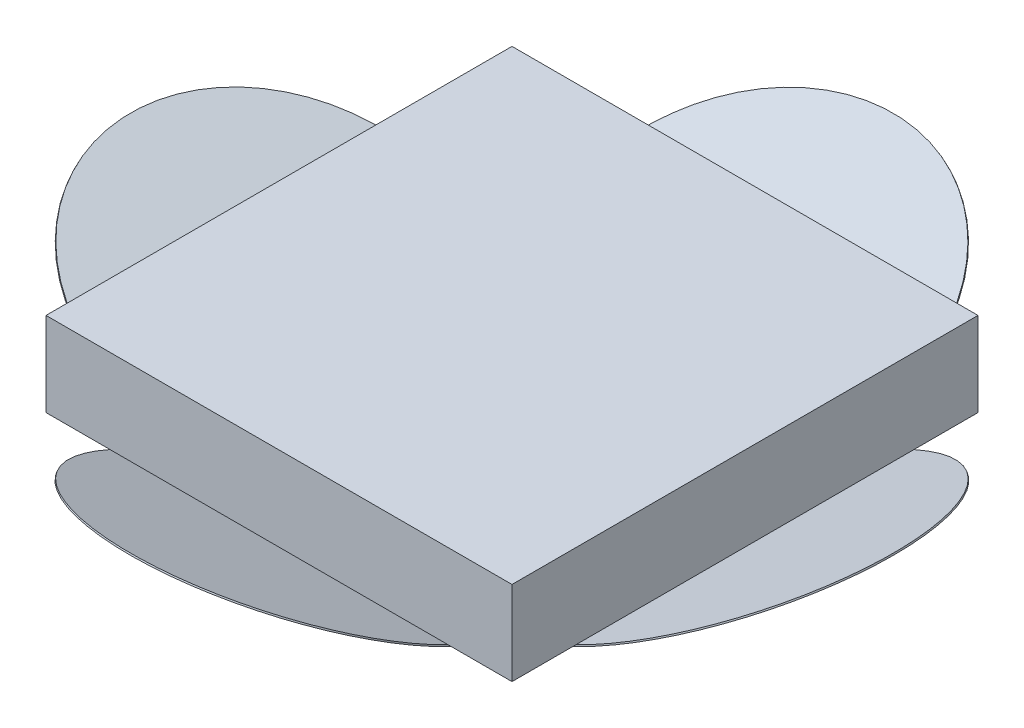
ISO-10303-21;
HEADER;
FILE_DESCRIPTION(('STEP AP214'),'2;1');
FILE_NAME('part.step','',(''),(''),'','','');
FILE_SCHEMA(('AUTOMOTIVE_DESIGN { 1 0 10303 214 1 1 1 1 }'));
ENDSEC;
DATA;
#1=APPLICATION_CONTEXT('core data for automotive mechanical design processes');
#2=APPLICATION_PROTOCOL_DEFINITION('international standard','automotive_design',2000,#1);
#3=PRODUCT_CONTEXT('',#1,'mechanical');
#4=PRODUCT('Part','Part','',(#3));
#5=PRODUCT_RELATED_PRODUCT_CATEGORY('part','',(#4));
#6=PRODUCT_DEFINITION_FORMATION('','',#4);
#7=PRODUCT_DEFINITION_CONTEXT('part definition',#1,'design');
#8=PRODUCT_DEFINITION('design','',#6,#7);
#9=PRODUCT_DEFINITION_SHAPE('','',#8);
#10=(LENGTH_UNIT() NAMED_UNIT(*) SI_UNIT(.MILLI.,.METRE.));
#11=(NAMED_UNIT(*) PLANE_ANGLE_UNIT() SI_UNIT($,.RADIAN.));
#12=(NAMED_UNIT(*) SI_UNIT($,.STERADIAN.) SOLID_ANGLE_UNIT());
#13=UNCERTAINTY_MEASURE_WITH_UNIT(LENGTH_MEASURE(1.E-05),#10,'distance_accuracy_value','');
#14=(GEOMETRIC_REPRESENTATION_CONTEXT(3) GLOBAL_UNCERTAINTY_ASSIGNED_CONTEXT((#13)) GLOBAL_UNIT_ASSIGNED_CONTEXT((#10,
#11,#12)) REPRESENTATION_CONTEXT('',''));
#15=CARTESIAN_POINT('',(0.,0.,0.));
#16=DIRECTION('',(0.,0.,1.));
#17=DIRECTION('',(1.,0.,0.));
#18=AXIS2_PLACEMENT_3D('',#15,#16,#17);
#19=CARTESIAN_POINT('',(-52.9596626410732,2.58867680453672,1.20347185474998));
#20=DIRECTION('',(0.,-0.906796627216048,-0.42156835373353));
#21=DIRECTION('',(0.,0.42156835373353,-0.906796627216049));
#22=AXIS2_PLACEMENT_3D('',#19,#20,#21);
#23=PLANE('',#22);
#24=DIRECTION('',(-1.,0.,0.));
#25=VECTOR('',#24,1.);
#26=CARTESIAN_POINT('',(0.,3.1481690140845,0.));
#27=LINE('',#26,#25);
#28=CARTESIAN_POINT('',(-47.5495984469937,3.1481690140845,0.));
#29=VERTEX_POINT('',#28);
#30=CARTESIAN_POINT('',(-51.9596626410732,3.1481690140845,0.));
#31=VERTEX_POINT('',#30);
#32=EDGE_CURVE('E330',#29,#31,#27,.T.);
#33=ORIENTED_EDGE('',*,*,#32,.F.);
#34=CARTESIAN_POINT('',(-35.9596626410732,2.98729015805943,0.3460516016962));
#35=DIRECTION('',(0.,-0.906796627216048,-0.42156835373353));
#36=DIRECTION('',(0.,0.42156835373353,-0.906796627216048));
#37=AXIS2_PLACEMENT_3D('',#34,#35,#36);
#38=CIRCLE('',#37,11.5962168702862);
#39=CARTESIAN_POINT('',(-44.5522706554002,-0.295515571756563,7.40739085365601));
#40=VERTEX_POINT('',#39);
#41=EDGE_CURVE('E159',#40,#29,#38,.T.);
#42=ORIENTED_EDGE('',*,*,#41,.F.);
#43=DIRECTION('',(-0.671741727957964,0.312291693517609,-0.671741727957964));
#44=VECTOR('',#43,1.);
#45=CARTESIAN_POINT('',(-28.739871455794,-7.64667610357636,23.2197911852792));
#46=LINE('',#45,#44);
#47=EDGE_CURVE('E141',#40,#31,#46,.T.);
#48=ORIENTED_EDGE('',*,*,#47,.T.);
#49=EDGE_LOOP('',(#33,#42,#48));
#50=FACE_BOUND('',#49,.T.);
#51=ADVANCED_FACE('F32',(#50),#23,.T.);
#52=CARTESIAN_POINT('',(-35.9596626410732,-4.29020631428936,16.));
#53=VERTEX_POINT('',#52);
#54=EDGE_CURVE('E157',#53,#40,#46,.T.);
#55=ORIENTED_EDGE('',*,*,#54,.T.);
#56=CARTESIAN_POINT('',(-27.3666314694174,-0.295318533680852,7.40696702330714));
#57=VERTEX_POINT('',#56);
#58=EDGE_CURVE('E119',#57,#40,#38,.T.);
#59=ORIENTED_EDGE('',*,*,#58,.F.);
#60=DIRECTION('',(-0.671741727957964,-0.312291693517609,0.671741727957964));
#61=VECTOR('',#60,1.);
#62=CARTESIAN_POINT('',(-34.3992450116317,-3.56477056448951,14.4395823705585));
#63=LINE('',#62,#61);
#64=EDGE_CURVE('E142',#57,#53,#63,.T.);
#65=ORIENTED_EDGE('',*,*,#64,.T.);
#66=EDGE_LOOP('',(#55,#59,#65));
#67=FACE_BOUND('',#66,.T.);
#68=ADVANCED_FACE('F154',(#67),#23,.T.);
#69=CARTESIAN_POINT('',(-19.9596626410732,3.1481690140845,0.));
#70=VERTEX_POINT('',#69);
#71=EDGE_CURVE('E132',#70,#57,#63,.T.);
#72=ORIENTED_EDGE('',*,*,#71,.T.);
#73=CARTESIAN_POINT('',(-24.3697268351527,3.1481690140845,0.));
#74=VERTEX_POINT('',#73);
#75=EDGE_CURVE('E115',#74,#57,#38,.T.);
#76=ORIENTED_EDGE('',*,*,#75,.F.);
#77=EDGE_CURVE('E138',#70,#74,#27,.T.);
#78=ORIENTED_EDGE('',*,*,#77,.F.);
#79=EDGE_LOOP('',(#72,#76,#78));
#80=FACE_BOUND('',#79,.T.);
#81=ADVANCED_FACE('F140',(#80),#23,.T.);
#82=CARTESIAN_POINT('',(-35.9596626410732,-4.29020631428936,32.));
#83=DIRECTION('',(0.42156835373353,0.906796627216049,0.));
#84=DIRECTION('',(-0.906796627216049,0.42156835373353,0.));
#85=AXIS2_PLACEMENT_3D('',#82,#83,#84);
#86=PLANE('',#85);
#87=CARTESIAN_POINT('',(-51.6219940888762,2.99118742484512,16.));
#88=DIRECTION('',(-0.42156835373353,-0.906796627216049,0.));
#89=DIRECTION('',(0.906796627216049,-0.42156835373353,0.));
#90=AXIS2_PLACEMENT_3D('',#87,#88,#89);
#91=CIRCLE('',#90,11.6024269112007);
#92=CARTESIAN_POINT('',(-51.9596626410732,3.1481690140845,4.40355024331792));
#93=VERTEX_POINT('',#92);
#94=EDGE_CURVE('E36',#93,#40,#91,.T.);
#95=ORIENTED_EDGE('',*,*,#94,.F.);
#96=DIRECTION('',(0.,0.,-1.));
#97=VECTOR('',#96,1.);
#98=CARTESIAN_POINT('',(-51.9596626410732,3.1481690140845,32.));
#99=LINE('',#98,#97);
#100=EDGE_CURVE('E305',#93,#31,#99,.T.);
#101=ORIENTED_EDGE('',*,*,#100,.T.);
#102=ORIENTED_EDGE('',*,*,#47,.F.);
#103=EDGE_LOOP('',(#95,#101,#102));
#104=FACE_BOUND('',#103,.T.);
#105=ADVANCED_FACE('F283',(#104),#86,.F.);
#106=CARTESIAN_POINT('',(-44.5570397132548,-0.293298970386691,24.5973770721816));
#107=VERTEX_POINT('',#106);
#108=EDGE_CURVE('E58',#40,#107,#91,.T.);
#109=ORIENTED_EDGE('',*,*,#108,.F.);
#110=ORIENTED_EDGE('',*,*,#54,.F.);
#111=CARTESIAN_POINT('',(-44.5545714308906,-0.294446471051778,24.5949087898174));
#112=DIRECTION('',(0.671741727957965,-0.312291693517609,-0.671741727957964));
#113=VECTOR('',#112,1.);
#114=LINE('',#111,#113);
#115=EDGE_CURVE('E166',#107,#53,#114,.T.);
#116=ORIENTED_EDGE('',*,*,#115,.F.);
#117=EDGE_LOOP('',(#109,#110,#116));
#118=FACE_BOUND('',#117,.T.);
#119=ADVANCED_FACE('F286',(#118),#86,.F.);
#120=CARTESIAN_POINT('',(-51.9596626410732,3.1481690140845,27.5964497566821));
#121=VERTEX_POINT('',#120);
#122=EDGE_CURVE('E235',#107,#121,#91,.T.);
#123=ORIENTED_EDGE('',*,*,#122,.F.);
#124=DIRECTION('',(0.671741727957964,-0.312291693517609,-0.671741727957964));
#125=VECTOR('',#124,1.);
#126=CARTESIAN_POINT('',(-43.1794538263524,-0.933736525002352,23.2197911852792));
#127=LINE('',#126,#125);
#128=CARTESIAN_POINT('',(-51.9596626410732,3.1481690140845,32.));
#129=VERTEX_POINT('',#128);
#130=EDGE_CURVE('E163',#129,#107,#127,.T.);
#131=ORIENTED_EDGE('',*,*,#130,.F.);
#132=EDGE_CURVE('E326',#129,#121,#99,.T.);
#133=ORIENTED_EDGE('',*,*,#132,.T.);
#134=EDGE_LOOP('',(#123,#131,#133));
#135=FACE_BOUND('',#134,.T.);
#136=ADVANCED_FACE('F259',(#135),#86,.F.);
#137=CARTESIAN_POINT('',(-52.9596626410732,-9.64417955727407,4.48356420507719));
#138=DIRECTION('',(0.,-0.906796627216048,0.42156835373353));
#139=DIRECTION('',(0.,-0.42156835373353,-0.906796627216049));
#140=AXIS2_PLACEMENT_3D('',#137,#138,#139);
#141=PLANE('',#140);
#142=DIRECTION('',(1.,0.,0.));
#143=VECTOR('',#142,1.);
#144=CARTESIAN_POINT('',(-52.9596626410732,3.1481690140845,32.));
#145=LINE('',#144,#143);
#146=CARTESIAN_POINT('',(-24.3552867854138,3.14816901408451,32.));
#147=VERTEX_POINT('',#146);
#148=CARTESIAN_POINT('',(-19.9596626410732,3.1481690140845,32.));
#149=VERTEX_POINT('',#148);
#150=EDGE_CURVE('E338',#147,#149,#145,.T.);
#151=ORIENTED_EDGE('',*,*,#150,.F.);
#152=CARTESIAN_POINT('',(-35.9596626410732,2.99593579768266,31.6725452326749));
#153=DIRECTION('',(0.,-0.906796627216048,0.42156835373353));
#154=DIRECTION('',(0.,-0.42156835373353,-0.906796627216048));
#155=AXIS2_PLACEMENT_3D('',#152,#153,#154);
#156=CIRCLE('',#155,11.6099931342026);
#157=CARTESIAN_POINT('',(-27.3608598825106,-0.292635818973298,24.5988035157456));
#158=VERTEX_POINT('',#157);
#159=EDGE_CURVE('E207',#158,#147,#156,.T.);
#160=ORIENTED_EDGE('',*,*,#159,.F.);
#161=DIRECTION('',(0.671741727957964,0.312291693517609,0.671741727957964));
#162=VECTOR('',#161,1.);
#163=CARTESIAN_POINT('',(-19.9596626410732,3.1481690140845,32.));
#164=LINE('',#163,#162);
#165=EDGE_CURVE('E213',#158,#149,#164,.T.);
#166=ORIENTED_EDGE('',*,*,#165,.T.);
#167=EDGE_LOOP('',(#151,#160,#166));
#168=FACE_BOUND('',#167,.T.);
#169=ADVANCED_FACE('F248',(#168),#141,.T.);
#170=ORIENTED_EDGE('',*,*,#130,.T.);
#171=CARTESIAN_POINT('',(-47.5640384967326,3.14816901408451,32.));
#172=VERTEX_POINT('',#171);
#173=EDGE_CURVE('E218',#172,#107,#156,.T.);
#174=ORIENTED_EDGE('',*,*,#173,.F.);
#175=EDGE_CURVE('E201',#129,#172,#145,.T.);
#176=ORIENTED_EDGE('',*,*,#175,.F.);
#177=EDGE_LOOP('',(#170,#174,#176));
#178=FACE_BOUND('',#177,.T.);
#179=ADVANCED_FACE('F258',(#178),#141,.T.);
#180=EDGE_CURVE('E162',#53,#158,#164,.T.);
#181=ORIENTED_EDGE('',*,*,#180,.T.);
#182=EDGE_CURVE('E224',#107,#158,#156,.T.);
#183=ORIENTED_EDGE('',*,*,#182,.F.);
#184=ORIENTED_EDGE('',*,*,#115,.T.);
#185=EDGE_LOOP('',(#181,#183,#184));
#186=FACE_BOUND('',#185,.T.);
#187=ADVANCED_FACE('F261',(#186),#141,.T.);
#188=CARTESIAN_POINT('',(-19.9596626410732,3.1481690140845,32.));
#189=DIRECTION('',(-0.42156835373353,0.906796627216049,0.));
#190=DIRECTION('',(-0.906796627216048,-0.42156835373353,0.));
#191=AXIS2_PLACEMENT_3D('',#188,#189,#190);
#192=PLANE('',#191);
#193=CARTESIAN_POINT('',(-20.294569642075,2.99247126573755,16.));
#194=DIRECTION('',(0.42156835373353,-0.906796627216048,0.));
#195=DIRECTION('',(0.906796627216048,0.42156835373353,0.));
#196=AXIS2_PLACEMENT_3D('',#193,#194,#195);
#197=CIRCLE('',#196,11.6044726280859);
#198=CARTESIAN_POINT('',(-19.9596626410732,3.14816901408451,27.5985939013242));
#199=VERTEX_POINT('',#198);
#200=EDGE_CURVE('E147',#199,#158,#197,.T.);
#201=ORIENTED_EDGE('',*,*,#200,.F.);
#202=DIRECTION('',(0.,0.,-1.));
#203=VECTOR('',#202,1.);
#204=CARTESIAN_POINT('',(-19.9596626410732,3.1481690140845,32.));
#205=LINE('',#204,#203);
#206=EDGE_CURVE('E322',#149,#199,#205,.T.);
#207=ORIENTED_EDGE('',*,*,#206,.F.);
#208=ORIENTED_EDGE('',*,*,#165,.F.);
#209=EDGE_LOOP('',(#201,#207,#208));
#210=FACE_BOUND('',#209,.T.);
#211=ADVANCED_FACE('F279',(#210),#192,.F.);
#212=EDGE_CURVE('E11',#158,#57,#197,.T.);
#213=ORIENTED_EDGE('',*,*,#212,.F.);
#214=ORIENTED_EDGE('',*,*,#180,.F.);
#215=ORIENTED_EDGE('',*,*,#64,.F.);
#216=EDGE_LOOP('',(#213,#214,#215));
#217=FACE_BOUND('',#216,.T.);
#218=ADVANCED_FACE('F161',(#217),#192,.F.);
#219=CARTESIAN_POINT('',(-19.9596626410732,3.14816901408451,4.40140609867577));
#220=VERTEX_POINT('',#219);
#221=EDGE_CURVE('E42',#57,#220,#197,.T.);
#222=ORIENTED_EDGE('',*,*,#221,.F.);
#223=ORIENTED_EDGE('',*,*,#71,.F.);
#224=EDGE_CURVE('E134',#220,#70,#205,.T.);
#225=ORIENTED_EDGE('',*,*,#224,.F.);
#226=EDGE_LOOP('',(#222,#223,#225));
#227=FACE_BOUND('',#226,.T.);
#228=ADVANCED_FACE('F131',(#227),#192,.F.);
#229=CARTESIAN_POINT('',(0.,0.,32.));
#230=DIRECTION('',(0.,0.,-1.));
#231=DIRECTION('',(-1.,0.,0.));
#232=AXIS2_PLACEMENT_3D('',#229,#230,#231);
#233=PLANE('',#232);
#234=ORIENTED_EDGE('',*,*,#175,.T.);
#235=DIRECTION('',(-1.,0.,0.));
#236=VECTOR('',#235,1.);
#237=CARTESIAN_POINT('',(0.,3.14816901408451,32.));
#238=LINE('',#237,#236);
#239=EDGE_CURVE('E198',#147,#172,#238,.T.);
#240=ORIENTED_EDGE('',*,*,#239,.F.);
#241=ORIENTED_EDGE('',*,*,#150,.T.);
#242=DIRECTION('',(0.,1.,0.));
#243=VECTOR('',#242,1.);
#244=CARTESIAN_POINT('',(-19.9596626410732,8.92782935791853,32.));
#245=LINE('',#244,#243);
#246=CARTESIAN_POINT('',(-19.9596626410732,8.92782935791853,32.));
#247=VERTEX_POINT('',#246);
#248=EDGE_CURVE('E321',#149,#247,#245,.T.);
#249=ORIENTED_EDGE('',*,*,#248,.T.);
#250=DIRECTION('',(-1.,0.,0.));
#251=VECTOR('',#250,1.);
#252=CARTESIAN_POINT('',(-51.9596626410732,8.92782935791853,32.));
#253=LINE('',#252,#251);
#254=CARTESIAN_POINT('',(-51.9596626410732,8.92782935791853,32.));
#255=VERTEX_POINT('',#254);
#256=EDGE_CURVE('E179',#247,#255,#253,.T.);
#257=ORIENTED_EDGE('',*,*,#256,.T.);
#258=DIRECTION('',(0.,-1.,0.));
#259=VECTOR('',#258,1.);
#260=CARTESIAN_POINT('',(-51.9596626410732,8.92782935791853,32.));
#261=LINE('',#260,#259);
#262=EDGE_CURVE('E401',#255,#129,#261,.T.);
#263=ORIENTED_EDGE('',*,*,#262,.T.);
#264=EDGE_LOOP('',(#234,#240,#241,#249,#257,#263));
#265=FACE_BOUND('',#264,.T.);
#266=ADVANCED_FACE('F266',(#265),#233,.F.);
#267=CARTESIAN_POINT('',(0.,0.,0.));
#268=DIRECTION('',(0.,0.,-1.));
#269=DIRECTION('',(-1.,0.,0.));
#270=AXIS2_PLACEMENT_3D('',#267,#268,#269);
#271=PLANE('',#270);
#272=DIRECTION('',(0.,1.,0.));
#273=VECTOR('',#272,1.);
#274=CARTESIAN_POINT('',(-19.9596626410732,8.92782935791853,0.));
#275=LINE('',#274,#273);
#276=CARTESIAN_POINT('',(-19.9596626410732,8.92782935791853,0.));
#277=VERTEX_POINT('',#276);
#278=EDGE_CURVE('E311',#70,#277,#275,.T.);
#279=ORIENTED_EDGE('',*,*,#278,.F.);
#280=ORIENTED_EDGE('',*,*,#77,.T.);
#281=DIRECTION('',(-1.,0.,0.));
#282=VECTOR('',#281,1.);
#283=CARTESIAN_POINT('',(0.,3.1481690140845,0.));
#284=LINE('',#283,#282);
#285=EDGE_CURVE('E189',#74,#29,#284,.T.);
#286=ORIENTED_EDGE('',*,*,#285,.T.);
#287=ORIENTED_EDGE('',*,*,#32,.T.);
#288=DIRECTION('',(0.,-1.,0.));
#289=VECTOR('',#288,1.);
#290=CARTESIAN_POINT('',(-51.9596626410732,8.92782935791853,0.));
#291=LINE('',#290,#289);
#292=CARTESIAN_POINT('',(-51.9596626410732,8.92782935791853,0.));
#293=VERTEX_POINT('',#292);
#294=EDGE_CURVE('E303',#293,#31,#291,.T.);
#295=ORIENTED_EDGE('',*,*,#294,.F.);
#296=DIRECTION('',(-1.,0.,0.));
#297=VECTOR('',#296,1.);
#298=CARTESIAN_POINT('',(-51.9596626410732,8.92782935791853,0.));
#299=LINE('',#298,#297);
#300=EDGE_CURVE('E312',#277,#293,#299,.T.);
#301=ORIENTED_EDGE('',*,*,#300,.F.);
#302=EDGE_LOOP('',(#279,#280,#286,#287,#295,#301));
#303=FACE_BOUND('',#302,.T.);
#304=ADVANCED_FACE('F269',(#303),#271,.T.);
#305=CARTESIAN_POINT('',(-51.9596626410732,8.92782935791853,32.));
#306=DIRECTION('',(0.,-1.,0.));
#307=DIRECTION('',(0.,0.,-1.));
#308=AXIS2_PLACEMENT_3D('',#305,#306,#307);
#309=PLANE('',#308);
#310=ORIENTED_EDGE('',*,*,#300,.T.);
#311=DIRECTION('',(0.,0.,-1.));
#312=VECTOR('',#311,1.);
#313=CARTESIAN_POINT('',(-51.9596626410732,8.92782935791853,32.));
#314=LINE('',#313,#312);
#315=EDGE_CURVE('E308',#255,#293,#314,.T.);
#316=ORIENTED_EDGE('',*,*,#315,.F.);
#317=ORIENTED_EDGE('',*,*,#256,.F.);
#318=DIRECTION('',(0.,0.,-1.));
#319=VECTOR('',#318,1.);
#320=CARTESIAN_POINT('',(-19.9596626410732,8.92782935791853,32.));
#321=LINE('',#320,#319);
#322=EDGE_CURVE('E318',#247,#277,#321,.T.);
#323=ORIENTED_EDGE('',*,*,#322,.T.);
#324=EDGE_LOOP('',(#310,#316,#317,#323));
#325=FACE_BOUND('',#324,.T.);
#326=ADVANCED_FACE('F34',(#325),#309,.F.);
#327=CARTESIAN_POINT('',(-51.9596626410732,8.92782935791853,32.));
#328=DIRECTION('',(1.,0.,0.));
#329=DIRECTION('',(0.,1.,0.));
#330=AXIS2_PLACEMENT_3D('',#327,#328,#329);
#331=PLANE('',#330);
#332=ORIENTED_EDGE('',*,*,#294,.T.);
#333=ORIENTED_EDGE('',*,*,#100,.F.);
#334=DIRECTION('',(0.,0.,-1.));
#335=VECTOR('',#334,1.);
#336=CARTESIAN_POINT('',(-51.9596626410732,3.1481690140845,32.));
#337=LINE('',#336,#335);
#338=EDGE_CURVE('E225',#121,#93,#337,.T.);
#339=ORIENTED_EDGE('',*,*,#338,.F.);
#340=ORIENTED_EDGE('',*,*,#132,.F.);
#341=ORIENTED_EDGE('',*,*,#262,.F.);
#342=ORIENTED_EDGE('',*,*,#315,.T.);
#343=EDGE_LOOP('',(#332,#333,#339,#340,#341,#342));
#344=FACE_BOUND('',#343,.T.);
#345=ADVANCED_FACE('F277',(#344),#331,.F.);
#346=CARTESIAN_POINT('',(-19.9596626410732,8.92782935791853,32.));
#347=DIRECTION('',(-1.,0.,0.));
#348=DIRECTION('',(0.,0.,1.));
#349=AXIS2_PLACEMENT_3D('',#346,#347,#348);
#350=PLANE('',#349);
#351=ORIENTED_EDGE('',*,*,#278,.T.);
#352=ORIENTED_EDGE('',*,*,#322,.F.);
#353=ORIENTED_EDGE('',*,*,#248,.F.);
#354=ORIENTED_EDGE('',*,*,#206,.T.);
#355=EDGE_CURVE('E325',#199,#220,#205,.T.);
#356=ORIENTED_EDGE('',*,*,#355,.T.);
#357=ORIENTED_EDGE('',*,*,#224,.T.);
#358=EDGE_LOOP('',(#351,#352,#353,#354,#356,#357));
#359=FACE_BOUND('',#358,.T.);
#360=ADVANCED_FACE('F274',(#359),#350,.F.);
#361=CARTESIAN_POINT('',(-20.2524128067016,2.90179160301595,16.));
#362=DIRECTION('',(-0.42156835373353,0.906796627216048,0.));
#363=DIRECTION('',(-0.906796627216049,-0.42156835373353,0.));
#364=AXIS2_PLACEMENT_3D('',#361,#362,#363);
#365=CYLINDRICAL_SURFACE('',#364,11.6044726280859);
#366=CARTESIAN_POINT('',(-20.2524128067016,2.90179160301595,16.));
#367=DIRECTION('',(0.42156835373353,-0.906796627216048,0.));
#368=DIRECTION('',(0.906796627216048,0.42156835373353,0.));
#369=AXIS2_PLACEMENT_3D('',#366,#367,#368);
#370=CIRCLE('',#369,11.6044726280859);
#371=CARTESIAN_POINT('',(-9.72951616693233,7.79387002478396,16.));
#372=VERTEX_POINT('',#371);
#373=EDGE_CURVE('E199',#372,#372,#370,.T.);
#374=ORIENTED_EDGE('',*,*,#373,.F.);
#375=EDGE_LOOP('',(#374));
#376=FACE_BOUND('',#375,.T.);
#377=ORIENTED_EDGE('',*,*,#200,.T.);
#378=ORIENTED_EDGE('',*,*,#212,.T.);
#379=ORIENTED_EDGE('',*,*,#221,.T.);
#380=EDGE_CURVE('E194',#220,#199,#197,.T.);
#381=ORIENTED_EDGE('',*,*,#380,.T.);
#382=EDGE_LOOP('',(#377,#378,#379,#381));
#383=FACE_BOUND('',#382,.T.);
#384=ADVANCED_FACE('F146',(#376,#383),#365,.T.);
#385=CARTESIAN_POINT('',(-20.2524128067016,2.90179160301595,16.));
#386=DIRECTION('',(0.42156835373353,-0.906796627216048,0.));
#387=DIRECTION('',(0.906796627216048,0.42156835373353,0.));
#388=AXIS2_PLACEMENT_3D('',#385,#386,#387);
#389=PLANE('',#388);
#390=ORIENTED_EDGE('',*,*,#373,.T.);
#391=EDGE_LOOP('',(#390));
#392=FACE_BOUND('',#391,.T.);
#393=ADVANCED_FACE('F344',(#392),#389,.T.);
#394=CARTESIAN_POINT('',(-20.294569642075,2.99247126573755,16.));
#395=DIRECTION('',(0.42156835373353,-0.906796627216048,0.));
#396=DIRECTION('',(0.906796627216048,0.42156835373353,0.));
#397=AXIS2_PLACEMENT_3D('',#394,#395,#396);
#398=PLANE('',#397);
#399=ORIENTED_EDGE('',*,*,#355,.F.);
#400=ORIENTED_EDGE('',*,*,#380,.F.);
#401=EDGE_LOOP('',(#399,#400));
#402=FACE_BOUND('',#401,.T.);
#403=ADVANCED_FACE('F350',(#402),#398,.F.);
#404=CARTESIAN_POINT('',(-35.9596626410732,2.99593579768266,31.6725452326749));
#405=DIRECTION('',(0.,-0.906796627216048,0.42156835373353));
#406=DIRECTION('',(0.,-0.42156835373353,-0.906796627216048));
#407=AXIS2_PLACEMENT_3D('',#404,#405,#406);
#408=PLANE('',#407);
#409=EDGE_CURVE('E212',#147,#172,#156,.T.);
#410=ORIENTED_EDGE('',*,*,#409,.F.);
#411=ORIENTED_EDGE('',*,*,#239,.T.);
#412=EDGE_LOOP('',(#410,#411));
#413=FACE_BOUND('',#412,.T.);
#414=ADVANCED_FACE('F355',(#413),#408,.F.);
#415=CARTESIAN_POINT('',(-35.9596626410732,2.90525613496105,31.7147020680482));
#416=DIRECTION('',(0.,0.906796627216048,-0.42156835373353));
#417=DIRECTION('',(0.,0.42156835373353,0.906796627216048));
#418=AXIS2_PLACEMENT_3D('',#415,#416,#417);
#419=CYLINDRICAL_SURFACE('',#418,11.6099931342026);
#420=CARTESIAN_POINT('',(-35.9596626410732,2.90525613496105,31.7147020680482));
#421=DIRECTION('',(0.,-0.906796627216048,0.42156835373353));
#422=DIRECTION('',(0.,-0.42156835373353,-0.906796627216048));
#423=AXIS2_PLACEMENT_3D('',#420,#421,#422);
#424=CIRCLE('',#423,11.6099931342026);
#425=CARTESIAN_POINT('',(-35.9596626410732,-1.98914955748232,21.1867994519519));
#426=VERTEX_POINT('',#425);
#427=EDGE_CURVE('E211',#426,#426,#424,.T.);
#428=ORIENTED_EDGE('',*,*,#427,.F.);
#429=EDGE_LOOP('',(#428));
#430=FACE_BOUND('',#429,.T.);
#431=ORIENTED_EDGE('',*,*,#173,.T.);
#432=ORIENTED_EDGE('',*,*,#182,.T.);
#433=ORIENTED_EDGE('',*,*,#159,.T.);
#434=ORIENTED_EDGE('',*,*,#409,.T.);
#435=EDGE_LOOP('',(#431,#432,#433,#434));
#436=FACE_BOUND('',#435,.T.);
#437=ADVANCED_FACE('F358',(#430,#436),#419,.T.);
#438=CARTESIAN_POINT('',(-35.9596626410732,2.90525613496105,31.7147020680482));
#439=DIRECTION('',(0.,-0.906796627216048,0.42156835373353));
#440=DIRECTION('',(0.,-0.42156835373353,-0.906796627216048));
#441=AXIS2_PLACEMENT_3D('',#438,#439,#440);
#442=PLANE('',#441);
#443=ORIENTED_EDGE('',*,*,#427,.T.);
#444=EDGE_LOOP('',(#443));
#445=FACE_BOUND('',#444,.T.);
#446=ADVANCED_FACE('F361',(#445),#442,.T.);
#447=CARTESIAN_POINT('',(-51.6219940888762,2.99118742484512,16.));
#448=DIRECTION('',(-0.42156835373353,-0.906796627216049,0.));
#449=DIRECTION('',(0.906796627216049,-0.42156835373353,0.));
#450=AXIS2_PLACEMENT_3D('',#447,#448,#449);
#451=PLANE('',#450);
#452=EDGE_CURVE('E236',#121,#93,#91,.T.);
#453=ORIENTED_EDGE('',*,*,#452,.F.);
#454=ORIENTED_EDGE('',*,*,#338,.T.);
#455=EDGE_LOOP('',(#453,#454));
#456=FACE_BOUND('',#455,.T.);
#457=ADVANCED_FACE('F368',(#456),#451,.F.);
#458=CARTESIAN_POINT('',(-51.6641509242495,2.90050776212351,16.));
#459=DIRECTION('',(0.42156835373353,0.906796627216048,0.));
#460=DIRECTION('',(-0.906796627216048,0.42156835373353,0.));
#461=AXIS2_PLACEMENT_3D('',#458,#459,#460);
#462=CYLINDRICAL_SURFACE('',#461,11.6024269112007);
#463=CARTESIAN_POINT('',(-51.6641509242495,2.90050776212351,16.));
#464=DIRECTION('',(-0.42156835373353,-0.906796627216049,0.));
#465=DIRECTION('',(0.906796627216049,-0.42156835373353,0.));
#466=AXIS2_PLACEMENT_3D('',#463,#464,#465);
#467=CIRCLE('',#466,11.6024269112007);
#468=CARTESIAN_POINT('',(-41.143109333652,-1.99070825014499,16.));
#469=VERTEX_POINT('',#468);
#470=EDGE_CURVE('E230',#469,#469,#467,.T.);
#471=ORIENTED_EDGE('',*,*,#470,.F.);
#472=EDGE_LOOP('',(#471));
#473=FACE_BOUND('',#472,.T.);
#474=ORIENTED_EDGE('',*,*,#94,.T.);
#475=ORIENTED_EDGE('',*,*,#108,.T.);
#476=ORIENTED_EDGE('',*,*,#122,.T.);
#477=ORIENTED_EDGE('',*,*,#452,.T.);
#478=EDGE_LOOP('',(#474,#475,#476,#477));
#479=FACE_BOUND('',#478,.T.);
#480=ADVANCED_FACE('F370',(#473,#479),#462,.T.);
#481=CARTESIAN_POINT('',(-51.6641509242495,2.90050776212351,16.));
#482=DIRECTION('',(-0.42156835373353,-0.906796627216049,0.));
#483=DIRECTION('',(0.906796627216049,-0.42156835373353,0.));
#484=AXIS2_PLACEMENT_3D('',#481,#482,#483);
#485=PLANE('',#484);
#486=ORIENTED_EDGE('',*,*,#470,.T.);
#487=EDGE_LOOP('',(#486));
#488=FACE_BOUND('',#487,.T.);
#489=ADVANCED_FACE('F373',(#488),#485,.T.);
#490=CARTESIAN_POINT('',(-35.9596626410732,2.89661049533782,0.303894766322847));
#491=DIRECTION('',(0.,0.906796627216048,0.42156835373353));
#492=DIRECTION('',(0.,-0.42156835373353,0.906796627216048));
#493=AXIS2_PLACEMENT_3D('',#490,#491,#492);
#494=CYLINDRICAL_SURFACE('',#493,11.5962168702862);
#495=CARTESIAN_POINT('',(-35.9596626410732,2.89661049533782,0.303894766322847));
#496=DIRECTION('',(0.,-0.906796627216048,-0.42156835373353));
#497=DIRECTION('',(0.,0.42156835373353,-0.906796627216048));
#498=AXIS2_PLACEMENT_3D('',#495,#496,#497);
#499=CIRCLE('',#498,11.5962168702862);
#500=CARTESIAN_POINT('',(-35.9596626410732,7.78520855088138,-10.2115155801186));
#501=VERTEX_POINT('',#500);
#502=EDGE_CURVE('E125',#501,#501,#499,.T.);
#503=ORIENTED_EDGE('',*,*,#502,.F.);
#504=EDGE_LOOP('',(#503));
#505=FACE_BOUND('',#504,.T.);
#506=ORIENTED_EDGE('',*,*,#75,.T.);
#507=ORIENTED_EDGE('',*,*,#58,.T.);
#508=ORIENTED_EDGE('',*,*,#41,.T.);
#509=EDGE_CURVE('E50',#29,#74,#38,.T.);
#510=ORIENTED_EDGE('',*,*,#509,.T.);
#511=EDGE_LOOP('',(#506,#507,#508,#510));
#512=FACE_BOUND('',#511,.T.);
#513=ADVANCED_FACE('F117',(#505,#512),#494,.T.);
#514=CARTESIAN_POINT('',(-35.9596626410732,2.89661049533782,0.303894766322847));
#515=DIRECTION('',(0.,-0.906796627216048,-0.42156835373353));
#516=DIRECTION('',(0.,0.42156835373353,-0.906796627216048));
#517=AXIS2_PLACEMENT_3D('',#514,#515,#516);
#518=PLANE('',#517);
#519=ORIENTED_EDGE('',*,*,#502,.T.);
#520=EDGE_LOOP('',(#519));
#521=FACE_BOUND('',#520,.T.);
#522=ADVANCED_FACE('F382',(#521),#518,.T.);
#523=CARTESIAN_POINT('',(-35.9596626410732,2.98729015805943,0.3460516016962));
#524=DIRECTION('',(0.,-0.906796627216048,-0.42156835373353));
#525=DIRECTION('',(0.,0.42156835373353,-0.906796627216048));
#526=AXIS2_PLACEMENT_3D('',#523,#524,#525);
#527=PLANE('',#526);
#528=ORIENTED_EDGE('',*,*,#285,.F.);
#529=ORIENTED_EDGE('',*,*,#509,.F.);
#530=EDGE_LOOP('',(#528,#529));
#531=FACE_BOUND('',#530,.T.);
#532=ADVANCED_FACE('F384',(#531),#527,.F.);
#533=CLOSED_SHELL('',(#51,#68,#81,#105,#119,#136,#169,#179,#187,#211,#218,#228,#266,#304,#326,
#345,#360,#384,#393,#403,#414,#437,#446,#457,#480,#489,#513,#522,#532));
#534=MANIFOLD_SOLID_BREP('B2',#533);
#535=ADVANCED_BREP_SHAPE_REPRESENTATION('',(#18,#534),#14);
#536=SHAPE_DEFINITION_REPRESENTATION(#9,#535);
ENDSEC;
END-ISO-10303-21;
